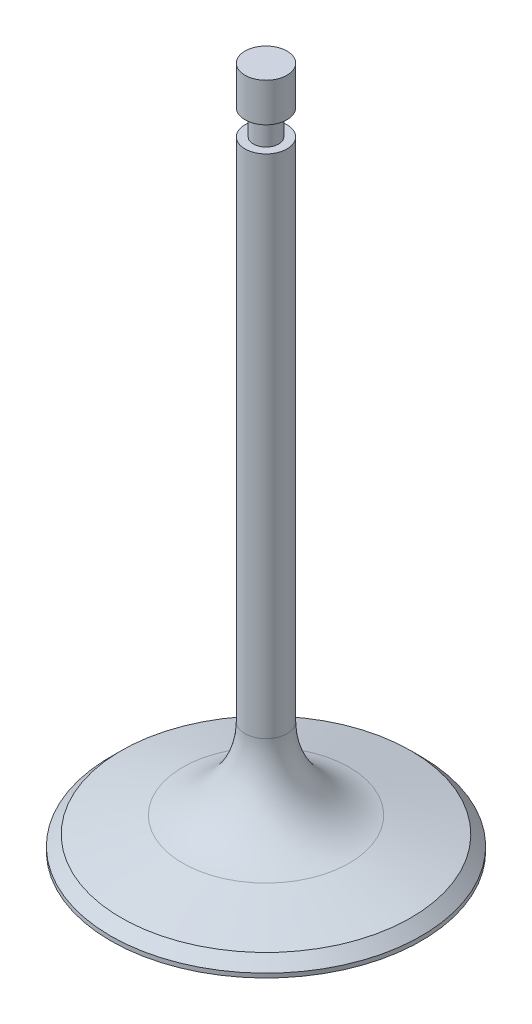
ISO-10303-21;
HEADER;
FILE_DESCRIPTION(('STEP AP214'),'2;1');
FILE_NAME('part.step','',(''),(''),'','','');
FILE_SCHEMA(('AUTOMOTIVE_DESIGN { 1 0 10303 214 1 1 1 1 }'));
ENDSEC;
DATA;
#1=APPLICATION_CONTEXT('core data for automotive mechanical design processes');
#2=APPLICATION_PROTOCOL_DEFINITION('international standard','automotive_design',2000,#1);
#3=PRODUCT_CONTEXT('',#1,'mechanical');
#4=PRODUCT('Part','Part','',(#3));
#5=PRODUCT_RELATED_PRODUCT_CATEGORY('part','',(#4));
#6=PRODUCT_DEFINITION_FORMATION('','',#4);
#7=PRODUCT_DEFINITION_CONTEXT('part definition',#1,'design');
#8=PRODUCT_DEFINITION('design','',#6,#7);
#9=PRODUCT_DEFINITION_SHAPE('','',#8);
#10=(LENGTH_UNIT() NAMED_UNIT(*) SI_UNIT(.MILLI.,.METRE.));
#11=(NAMED_UNIT(*) PLANE_ANGLE_UNIT() SI_UNIT($,.RADIAN.));
#12=(NAMED_UNIT(*) SI_UNIT($,.STERADIAN.) SOLID_ANGLE_UNIT());
#13=UNCERTAINTY_MEASURE_WITH_UNIT(LENGTH_MEASURE(1.E-05),#10,'distance_accuracy_value','');
#14=(GEOMETRIC_REPRESENTATION_CONTEXT(3) GLOBAL_UNCERTAINTY_ASSIGNED_CONTEXT((#13)) GLOBAL_UNIT_ASSIGNED_CONTEXT((#10,
#11,#12)) REPRESENTATION_CONTEXT('',''));
#15=CARTESIAN_POINT('',(0.,0.,0.));
#16=DIRECTION('',(0.,0.,1.));
#17=DIRECTION('',(1.,0.,0.));
#18=AXIS2_PLACEMENT_3D('',#15,#16,#17);
#19=CARTESIAN_POINT('',(0.,114.833333333333,0.));
#20=DIRECTION('',(0.,-1.,0.));
#21=DIRECTION('',(0.,0.,-1.));
#22=AXIS2_PLACEMENT_3D('',#19,#20,#21);
#23=SPHERICAL_SURFACE('',#22,114.833333333333);
#24=CARTESIAN_POINT('',(0.,1.5,0.));
#25=DIRECTION('',(0.,-1.,0.));
#26=DIRECTION('',(0.,0.,-1.));
#27=AXIS2_PLACEMENT_3D('',#24,#25,#26);
#28=CIRCLE('',#27,18.5);
#29=CARTESIAN_POINT('',(0.,1.5,-18.5));
#30=VERTEX_POINT('',#29);
#31=EDGE_CURVE('E70',#30,#30,#28,.T.);
#32=ORIENTED_EDGE('',*,*,#31,.T.);
#33=EDGE_LOOP('',(#32));
#34=FACE_BOUND('',#33,.T.);
#35=ADVANCED_FACE('F36',(#34),#23,.T.);
#36=CARTESIAN_POINT('',(0.,82.79,0.));
#37=DIRECTION('',(0.,1.,0.));
#38=DIRECTION('',(0.,0.,1.));
#39=AXIS2_PLACEMENT_3D('',#36,#37,#38);
#40=PLANE('',#39);
#41=CARTESIAN_POINT('',(0.,82.79,0.));
#42=DIRECTION('',(0.,-1.,0.));
#43=DIRECTION('',(0.,0.,-1.));
#44=AXIS2_PLACEMENT_3D('',#41,#42,#43);
#45=CIRCLE('',#44,2.5);
#46=CARTESIAN_POINT('',(0.,82.79,-2.5));
#47=VERTEX_POINT('',#46);
#48=EDGE_CURVE('E10',#47,#47,#45,.T.);
#49=ORIENTED_EDGE('',*,*,#48,.F.);
#50=EDGE_LOOP('',(#49));
#51=FACE_BOUND('',#50,.T.);
#52=ADVANCED_FACE('F87',(#51),#40,.T.);
#53=CARTESIAN_POINT('',(0.,0.,0.));
#54=DIRECTION('',(0.,-1.,0.));
#55=DIRECTION('',(0.,0.,-1.));
#56=AXIS2_PLACEMENT_3D('',#53,#54,#55);
#57=CYLINDRICAL_SURFACE('',#56,2.5);
#58=ORIENTED_EDGE('',*,*,#48,.T.);
#59=EDGE_LOOP('',(#58));
#60=FACE_BOUND('',#59,.T.);
#61=CARTESIAN_POINT('',(0.,78.19,0.));
#62=DIRECTION('',(0.,-1.,0.));
#63=DIRECTION('',(0.,0.,-1.));
#64=AXIS2_PLACEMENT_3D('',#61,#62,#63);
#65=CIRCLE('',#64,2.5);
#66=CARTESIAN_POINT('',(0.,78.19,-2.5));
#67=VERTEX_POINT('',#66);
#68=EDGE_CURVE('E42',#67,#67,#65,.T.);
#69=ORIENTED_EDGE('',*,*,#68,.F.);
#70=EDGE_LOOP('',(#69));
#71=FACE_BOUND('',#70,.T.);
#72=ADVANCED_FACE('F91',(#60,#71),#57,.T.);
#73=CARTESIAN_POINT('',(0.,78.19,-2.5));
#74=DIRECTION('',(0.,-1.,0.));
#75=DIRECTION('',(0.,0.,-1.));
#76=AXIS2_PLACEMENT_3D('',#73,#74,#75);
#77=PLANE('',#76);
#78=ORIENTED_EDGE('',*,*,#68,.T.);
#79=EDGE_LOOP('',(#78));
#80=FACE_BOUND('',#79,.T.);
#81=CARTESIAN_POINT('',(0.,78.19,0.));
#82=DIRECTION('',(0.,-1.,0.));
#83=DIRECTION('',(0.,0.,-1.));
#84=AXIS2_PLACEMENT_3D('',#81,#82,#83);
#85=CIRCLE('',#84,1.5);
#86=CARTESIAN_POINT('',(0.,78.19,-1.5));
#87=VERTEX_POINT('',#86);
#88=EDGE_CURVE('E46',#87,#87,#85,.T.);
#89=ORIENTED_EDGE('',*,*,#88,.F.);
#90=EDGE_LOOP('',(#89));
#91=FACE_BOUND('',#90,.T.);
#92=ADVANCED_FACE('F96',(#80,#91),#77,.T.);
#93=CARTESIAN_POINT('',(0.,0.,0.));
#94=DIRECTION('',(0.,-1.,0.));
#95=DIRECTION('',(0.,0.,-1.));
#96=AXIS2_PLACEMENT_3D('',#93,#94,#95);
#97=CYLINDRICAL_SURFACE('',#96,1.5);
#98=ORIENTED_EDGE('',*,*,#88,.T.);
#99=EDGE_LOOP('',(#98));
#100=FACE_BOUND('',#99,.T.);
#101=CARTESIAN_POINT('',(0.,75.19,0.));
#102=DIRECTION('',(0.,-1.,0.));
#103=DIRECTION('',(0.,0.,-1.));
#104=AXIS2_PLACEMENT_3D('',#101,#102,#103);
#105=CIRCLE('',#104,1.5);
#106=CARTESIAN_POINT('',(0.,75.19,-1.5));
#107=VERTEX_POINT('',#106);
#108=EDGE_CURVE('E50',#107,#107,#105,.T.);
#109=ORIENTED_EDGE('',*,*,#108,.F.);
#110=EDGE_LOOP('',(#109));
#111=FACE_BOUND('',#110,.T.);
#112=ADVANCED_FACE('F101',(#100,#111),#97,.T.);
#113=CARTESIAN_POINT('',(0.,75.19,-1.5));
#114=DIRECTION('',(0.,1.,0.));
#115=DIRECTION('',(0.,0.,1.));
#116=AXIS2_PLACEMENT_3D('',#113,#114,#115);
#117=PLANE('',#116);
#118=ORIENTED_EDGE('',*,*,#108,.T.);
#119=EDGE_LOOP('',(#118));
#120=FACE_BOUND('',#119,.T.);
#121=CARTESIAN_POINT('',(0.,75.19,0.));
#122=DIRECTION('',(0.,-1.,0.));
#123=DIRECTION('',(0.,0.,-1.));
#124=AXIS2_PLACEMENT_3D('',#121,#122,#123);
#125=CIRCLE('',#124,2.5);
#126=CARTESIAN_POINT('',(0.,75.19,-2.5));
#127=VERTEX_POINT('',#126);
#128=EDGE_CURVE('E55',#127,#127,#125,.T.);
#129=ORIENTED_EDGE('',*,*,#128,.F.);
#130=EDGE_LOOP('',(#129));
#131=FACE_BOUND('',#130,.T.);
#132=ADVANCED_FACE('F104',(#120,#131),#117,.T.);
#133=CARTESIAN_POINT('',(0.,0.,0.));
#134=DIRECTION('',(0.,-1.,0.));
#135=DIRECTION('',(0.,0.,-1.));
#136=AXIS2_PLACEMENT_3D('',#133,#134,#135);
#137=CYLINDRICAL_SURFACE('',#136,2.5);
#138=ORIENTED_EDGE('',*,*,#128,.T.);
#139=EDGE_LOOP('',(#138));
#140=FACE_BOUND('',#139,.T.);
#141=CARTESIAN_POINT('',(0.,14.8755204681496,0.));
#142=DIRECTION('',(0.,-1.,0.));
#143=DIRECTION('',(0.,0.,-1.));
#144=AXIS2_PLACEMENT_3D('',#141,#142,#143);
#145=CIRCLE('',#144,2.50000000000001);
#146=CARTESIAN_POINT('',(0.,14.8755204681496,-2.50000000000001));
#147=VERTEX_POINT('',#146);
#148=EDGE_CURVE('E58',#147,#147,#145,.T.);
#149=ORIENTED_EDGE('',*,*,#148,.F.);
#150=EDGE_LOOP('',(#149));
#151=FACE_BOUND('',#150,.T.);
#152=ADVANCED_FACE('F108',(#140,#151),#137,.T.);
#153=CARTESIAN_POINT('',(0.,14.8755204681496,0.));
#154=DIRECTION('',(0.,-1.,0.));
#155=DIRECTION('',(0.,0.,-1.));
#156=AXIS2_PLACEMENT_3D('',#153,#154,#155);
#157=TOROIDAL_SURFACE('',#156,12.5,10.);
#158=ORIENTED_EDGE('',*,*,#148,.T.);
#159=EDGE_LOOP('',(#158));
#160=FACE_BOUND('',#159,.T.);
#161=CARTESIAN_POINT('',(0.,5.21626220525889,0.));
#162=DIRECTION('',(0.,-1.,0.));
#163=DIRECTION('',(0.,0.,-1.));
#164=AXIS2_PLACEMENT_3D('',#161,#162,#163);
#165=CIRCLE('',#164,9.91180954897477);
#166=CARTESIAN_POINT('',(0.,5.21626220525889,-9.91180954897477));
#167=VERTEX_POINT('',#166);
#168=EDGE_CURVE('E61',#167,#167,#165,.T.);
#169=ORIENTED_EDGE('',*,*,#168,.F.);
#170=EDGE_LOOP('',(#169));
#171=FACE_BOUND('',#170,.T.);
#172=ADVANCED_FACE('F112',(#160,#171),#157,.F.);
#173=CARTESIAN_POINT('',(0.,3.25,0.));
#174=DIRECTION('',(0.,-1.,0.));
#175=DIRECTION('',(0.,0.,-1.));
#176=AXIS2_PLACEMENT_3D('',#173,#174,#175);
#177=CONICAL_SURFACE('',#176,17.2500000000033,1.30899693899574);
#178=ORIENTED_EDGE('',*,*,#168,.T.);
#179=EDGE_LOOP('',(#178));
#180=FACE_BOUND('',#179,.T.);
#181=CARTESIAN_POINT('',(0.,3.25,0.));
#182=DIRECTION('',(0.,-1.,0.));
#183=DIRECTION('',(0.,0.,-1.));
#184=AXIS2_PLACEMENT_3D('',#181,#182,#183);
#185=CIRCLE('',#184,17.2500000000033);
#186=CARTESIAN_POINT('',(0.,3.25,-17.2500000000033));
#187=VERTEX_POINT('',#186);
#188=EDGE_CURVE('E64',#187,#187,#185,.T.);
#189=ORIENTED_EDGE('',*,*,#188,.F.);
#190=EDGE_LOOP('',(#189));
#191=FACE_BOUND('',#190,.T.);
#192=ADVANCED_FACE('F83',(#180,#191),#177,.T.);
#193=CARTESIAN_POINT('',(0.,2.,0.));
#194=DIRECTION('',(0.,-1.,0.));
#195=DIRECTION('',(0.,0.,-1.));
#196=AXIS2_PLACEMENT_3D('',#193,#194,#195);
#197=CONICAL_SURFACE('',#196,18.5,0.785398163396129);
#198=ORIENTED_EDGE('',*,*,#188,.T.);
#199=EDGE_LOOP('',(#198));
#200=FACE_BOUND('',#199,.T.);
#201=CARTESIAN_POINT('',(0.,2.,0.));
#202=DIRECTION('',(0.,-1.,0.));
#203=DIRECTION('',(0.,0.,-1.));
#204=AXIS2_PLACEMENT_3D('',#201,#202,#203);
#205=CIRCLE('',#204,18.5);
#206=CARTESIAN_POINT('',(0.,2.,-18.5));
#207=VERTEX_POINT('',#206);
#208=EDGE_CURVE('E67',#207,#207,#205,.T.);
#209=ORIENTED_EDGE('',*,*,#208,.F.);
#210=EDGE_LOOP('',(#209));
#211=FACE_BOUND('',#210,.T.);
#212=ADVANCED_FACE('F77',(#200,#211),#197,.T.);
#213=CARTESIAN_POINT('',(0.,0.,0.));
#214=DIRECTION('',(0.,-1.,0.));
#215=DIRECTION('',(0.,0.,-1.));
#216=AXIS2_PLACEMENT_3D('',#213,#214,#215);
#217=CYLINDRICAL_SURFACE('',#216,18.5);
#218=ORIENTED_EDGE('',*,*,#208,.T.);
#219=EDGE_LOOP('',(#218));
#220=FACE_BOUND('',#219,.T.);
#221=ORIENTED_EDGE('',*,*,#31,.F.);
#222=EDGE_LOOP('',(#221));
#223=FACE_BOUND('',#222,.T.);
#224=ADVANCED_FACE('F75',(#220,#223),#217,.T.);
#225=CLOSED_SHELL('',(#35,#52,#72,#92,#112,#132,#152,#172,#192,#212,#224));
#226=MANIFOLD_SOLID_BREP('B2',#225);
#227=ADVANCED_BREP_SHAPE_REPRESENTATION('',(#18,#226),#14);
#228=SHAPE_DEFINITION_REPRESENTATION(#9,#227);
ENDSEC;
END-ISO-10303-21;
